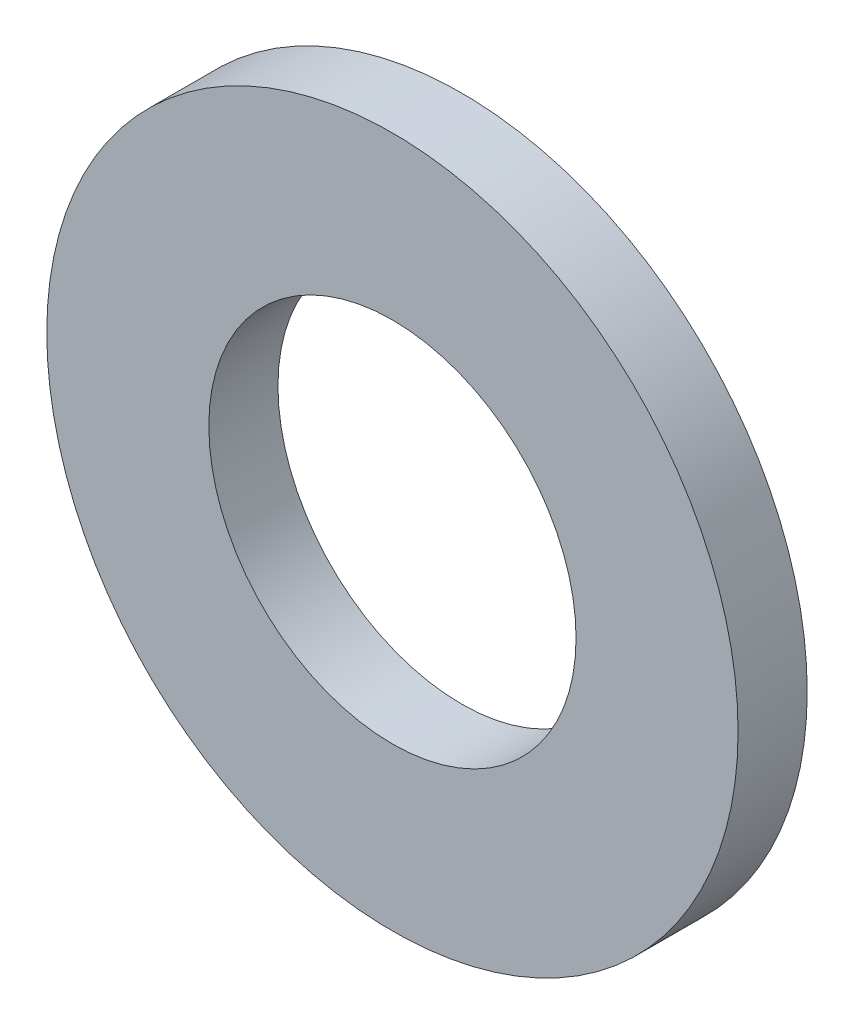
ISO-10303-21;
HEADER;
FILE_DESCRIPTION(('STEP AP214'),'2;1');
FILE_NAME('part.step','',(''),(''),'','','');
FILE_SCHEMA(('AUTOMOTIVE_DESIGN { 1 0 10303 214 1 1 1 1 }'));
ENDSEC;
DATA;
#1=APPLICATION_CONTEXT('core data for automotive mechanical design processes');
#2=APPLICATION_PROTOCOL_DEFINITION('international standard','automotive_design',2000,#1);
#3=PRODUCT_CONTEXT('',#1,'mechanical');
#4=PRODUCT('Part','Part','',(#3));
#5=PRODUCT_RELATED_PRODUCT_CATEGORY('part','',(#4));
#6=PRODUCT_DEFINITION_FORMATION('','',#4);
#7=PRODUCT_DEFINITION_CONTEXT('part definition',#1,'design');
#8=PRODUCT_DEFINITION('design','',#6,#7);
#9=PRODUCT_DEFINITION_SHAPE('','',#8);
#10=(LENGTH_UNIT() NAMED_UNIT(*) SI_UNIT(.MILLI.,.METRE.));
#11=(NAMED_UNIT(*) PLANE_ANGLE_UNIT() SI_UNIT($,.RADIAN.));
#12=(NAMED_UNIT(*) SI_UNIT($,.STERADIAN.) SOLID_ANGLE_UNIT());
#13=UNCERTAINTY_MEASURE_WITH_UNIT(LENGTH_MEASURE(1.E-05),#10,'distance_accuracy_value','');
#14=(GEOMETRIC_REPRESENTATION_CONTEXT(3) GLOBAL_UNCERTAINTY_ASSIGNED_CONTEXT((#13)) GLOBAL_UNIT_ASSIGNED_CONTEXT((#10,
#11,#12)) REPRESENTATION_CONTEXT('',''));
#15=CARTESIAN_POINT('',(0.,0.,0.));
#16=DIRECTION('',(0.,0.,1.));
#17=DIRECTION('',(1.,0.,0.));
#18=AXIS2_PLACEMENT_3D('',#15,#16,#17);
#19=CARTESIAN_POINT('',(4.25,0.,0.));
#20=DIRECTION('',(0.,0.,-1.));
#21=DIRECTION('',(-1.,0.,0.));
#22=AXIS2_PLACEMENT_3D('',#19,#20,#21);
#23=PLANE('',#22);
#24=CARTESIAN_POINT('',(0.,0.,0.));
#25=DIRECTION('',(0.,0.,-1.));
#26=DIRECTION('',(-1.,0.,0.));
#27=AXIS2_PLACEMENT_3D('',#24,#25,#26);
#28=CIRCLE('',#27,8.);
#29=CARTESIAN_POINT('',(-8.,0.,0.));
#30=VERTEX_POINT('',#29);
#31=EDGE_CURVE('E10',#30,#30,#28,.T.);
#32=ORIENTED_EDGE('',*,*,#31,.T.);
#33=EDGE_LOOP('',(#32));
#34=FACE_BOUND('',#33,.T.);
#35=CARTESIAN_POINT('',(0.,0.,0.));
#36=DIRECTION('',(0.,0.,-1.));
#37=DIRECTION('',(-1.,0.,0.));
#38=AXIS2_PLACEMENT_3D('',#35,#36,#37);
#39=CIRCLE('',#38,4.25);
#40=CARTESIAN_POINT('',(-4.25,0.,0.));
#41=VERTEX_POINT('',#40);
#42=EDGE_CURVE('E44',#41,#41,#39,.T.);
#43=ORIENTED_EDGE('',*,*,#42,.F.);
#44=EDGE_LOOP('',(#43));
#45=FACE_BOUND('',#44,.T.);
#46=ADVANCED_FACE('F30',(#34,#45),#23,.T.);
#47=CARTESIAN_POINT('',(0.,0.,1.6));
#48=DIRECTION('',(0.,0.,-1.));
#49=DIRECTION('',(-1.,0.,0.));
#50=AXIS2_PLACEMENT_3D('',#47,#48,#49);
#51=CYLINDRICAL_SURFACE('',#50,8.);
#52=CARTESIAN_POINT('',(0.,0.,1.6));
#53=DIRECTION('',(0.,0.,-1.));
#54=DIRECTION('',(-1.,0.,0.));
#55=AXIS2_PLACEMENT_3D('',#52,#53,#54);
#56=CIRCLE('',#55,8.);
#57=CARTESIAN_POINT('',(-8.,0.,1.6));
#58=VERTEX_POINT('',#57);
#59=EDGE_CURVE('E36',#58,#58,#56,.T.);
#60=ORIENTED_EDGE('',*,*,#59,.T.);
#61=EDGE_LOOP('',(#60));
#62=FACE_BOUND('',#61,.T.);
#63=ORIENTED_EDGE('',*,*,#31,.F.);
#64=EDGE_LOOP('',(#63));
#65=FACE_BOUND('',#64,.T.);
#66=ADVANCED_FACE('F54',(#62,#65),#51,.T.);
#67=CARTESIAN_POINT('',(8.,0.,1.6));
#68=DIRECTION('',(0.,0.,1.));
#69=DIRECTION('',(1.,0.,0.));
#70=AXIS2_PLACEMENT_3D('',#67,#68,#69);
#71=PLANE('',#70);
#72=CARTESIAN_POINT('',(0.,0.,1.6));
#73=DIRECTION('',(0.,0.,-1.));
#74=DIRECTION('',(-1.,0.,0.));
#75=AXIS2_PLACEMENT_3D('',#72,#73,#74);
#76=CIRCLE('',#75,4.25);
#77=CARTESIAN_POINT('',(-4.25,0.,1.6));
#78=VERTEX_POINT('',#77);
#79=EDGE_CURVE('E40',#78,#78,#76,.T.);
#80=ORIENTED_EDGE('',*,*,#79,.T.);
#81=EDGE_LOOP('',(#80));
#82=FACE_BOUND('',#81,.T.);
#83=ORIENTED_EDGE('',*,*,#59,.F.);
#84=EDGE_LOOP('',(#83));
#85=FACE_BOUND('',#84,.T.);
#86=ADVANCED_FACE('F58',(#82,#85),#71,.T.);
#87=CARTESIAN_POINT('',(0.,0.,1.6));
#88=DIRECTION('',(0.,0.,-1.));
#89=DIRECTION('',(-1.,0.,0.));
#90=AXIS2_PLACEMENT_3D('',#87,#88,#89);
#91=CYLINDRICAL_SURFACE('',#90,4.25);
#92=ORIENTED_EDGE('',*,*,#42,.T.);
#93=EDGE_LOOP('',(#92));
#94=FACE_BOUND('',#93,.T.);
#95=ORIENTED_EDGE('',*,*,#79,.F.);
#96=EDGE_LOOP('',(#95));
#97=FACE_BOUND('',#96,.T.);
#98=ADVANCED_FACE('F50',(#94,#97),#91,.F.);
#99=CLOSED_SHELL('',(#46,#66,#86,#98));
#100=MANIFOLD_SOLID_BREP('B2',#99);
#101=ADVANCED_BREP_SHAPE_REPRESENTATION('',(#18,#100),#14);
#102=SHAPE_DEFINITION_REPRESENTATION(#9,#101);
ENDSEC;
END-ISO-10303-21;
